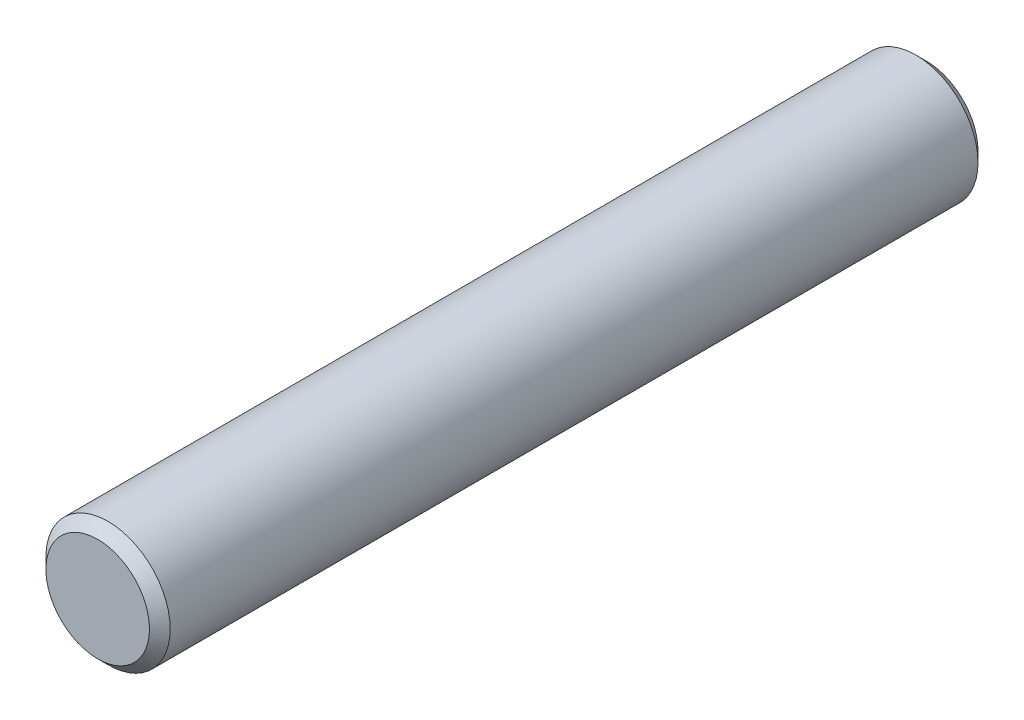
ISO-10303-21;
HEADER;
FILE_DESCRIPTION(('STEP AP214'),'2;1');
FILE_NAME('part.step','',(''),(''),'','','');
FILE_SCHEMA(('AUTOMOTIVE_DESIGN { 1 0 10303 214 1 1 1 1 }'));
ENDSEC;
DATA;
#1=APPLICATION_CONTEXT('core data for automotive mechanical design processes');
#2=APPLICATION_PROTOCOL_DEFINITION('international standard','automotive_design',2000,#1);
#3=PRODUCT_CONTEXT('',#1,'mechanical');
#4=PRODUCT('Part','Part','',(#3));
#5=PRODUCT_RELATED_PRODUCT_CATEGORY('part','',(#4));
#6=PRODUCT_DEFINITION_FORMATION('','',#4);
#7=PRODUCT_DEFINITION_CONTEXT('part definition',#1,'design');
#8=PRODUCT_DEFINITION('design','',#6,#7);
#9=PRODUCT_DEFINITION_SHAPE('','',#8);
#10=(LENGTH_UNIT() NAMED_UNIT(*) SI_UNIT(.MILLI.,.METRE.));
#11=(NAMED_UNIT(*) PLANE_ANGLE_UNIT() SI_UNIT($,.RADIAN.));
#12=(NAMED_UNIT(*) SI_UNIT($,.STERADIAN.) SOLID_ANGLE_UNIT());
#13=UNCERTAINTY_MEASURE_WITH_UNIT(LENGTH_MEASURE(1.E-05),#10,'distance_accuracy_value','');
#14=(GEOMETRIC_REPRESENTATION_CONTEXT(3) GLOBAL_UNCERTAINTY_ASSIGNED_CONTEXT((#13)) GLOBAL_UNIT_ASSIGNED_CONTEXT((#10,
#11,#12)) REPRESENTATION_CONTEXT('',''));
#15=CARTESIAN_POINT('',(0.,0.,0.));
#16=DIRECTION('',(0.,0.,1.));
#17=DIRECTION('',(1.,0.,0.));
#18=AXIS2_PLACEMENT_3D('',#15,#16,#17);
#19=CARTESIAN_POINT('',(0.,0.,10.));
#20=DIRECTION('',(0.,0.,-1.));
#21=DIRECTION('',(-1.,0.,0.));
#22=AXIS2_PLACEMENT_3D('',#19,#20,#21);
#23=CYLINDRICAL_SURFACE('',#22,1.5);
#24=CARTESIAN_POINT('',(0.,0.,-9.75));
#25=DIRECTION('',(0.,0.,1.));
#26=DIRECTION('',(1.,0.,0.));
#27=AXIS2_PLACEMENT_3D('',#24,#25,#26);
#28=CIRCLE('',#27,1.5);
#29=CARTESIAN_POINT('',(1.5,0.,-9.75));
#30=VERTEX_POINT('',#29);
#31=EDGE_CURVE('E59',#30,#30,#28,.T.);
#32=ORIENTED_EDGE('',*,*,#31,.T.);
#33=EDGE_LOOP('',(#32));
#34=FACE_BOUND('',#33,.T.);
#35=CARTESIAN_POINT('',(0.,0.,9.74999999999999));
#36=DIRECTION('',(0.,0.,1.));
#37=DIRECTION('',(1.,0.,0.));
#38=AXIS2_PLACEMENT_3D('',#35,#36,#37);
#39=CIRCLE('',#38,1.5);
#40=CARTESIAN_POINT('',(1.5,0.,9.74999999999999));
#41=VERTEX_POINT('',#40);
#42=EDGE_CURVE('E64',#41,#41,#39,.F.);
#43=ORIENTED_EDGE('',*,*,#42,.T.);
#44=EDGE_LOOP('',(#43));
#45=FACE_BOUND('',#44,.T.);
#46=ADVANCED_FACE('F45',(#34,#45),#23,.T.);
#47=CARTESIAN_POINT('',(0.,0.,10.));
#48=DIRECTION('',(0.,0.,1.));
#49=DIRECTION('',(1.,0.,0.));
#50=AXIS2_PLACEMENT_3D('',#47,#48,#49);
#51=PLANE('',#50);
#52=CARTESIAN_POINT('',(0.,0.,10.));
#53=DIRECTION('',(0.,0.,1.));
#54=DIRECTION('',(1.,0.,0.));
#55=AXIS2_PLACEMENT_3D('',#52,#53,#54);
#56=CIRCLE('',#55,1.25);
#57=CARTESIAN_POINT('',(1.25,0.,10.));
#58=VERTEX_POINT('',#57);
#59=EDGE_CURVE('E10',#58,#58,#56,.T.);
#60=ORIENTED_EDGE('',*,*,#59,.T.);
#61=EDGE_LOOP('',(#60));
#62=FACE_BOUND('',#61,.T.);
#63=ADVANCED_FACE('F81',(#62),#51,.T.);
#64=CARTESIAN_POINT('',(0.,0.,-10.));
#65=DIRECTION('',(0.,0.,1.));
#66=DIRECTION('',(1.,0.,0.));
#67=AXIS2_PLACEMENT_3D('',#64,#65,#66);
#68=PLANE('',#67);
#69=CARTESIAN_POINT('',(0.,0.,-10.));
#70=DIRECTION('',(0.,0.,1.));
#71=DIRECTION('',(1.,0.,0.));
#72=AXIS2_PLACEMENT_3D('',#69,#70,#71);
#73=CIRCLE('',#72,1.25);
#74=CARTESIAN_POINT('',(1.25,0.,-10.));
#75=VERTEX_POINT('',#74);
#76=EDGE_CURVE('E54',#75,#75,#73,.F.);
#77=ORIENTED_EDGE('',*,*,#76,.T.);
#78=EDGE_LOOP('',(#77));
#79=FACE_BOUND('',#78,.T.);
#80=ADVANCED_FACE('F78',(#79),#68,.F.);
#81=CARTESIAN_POINT('',(0.,0.,-9.75));
#82=DIRECTION('',(0.,0.,1.));
#83=DIRECTION('',(1.,0.,0.));
#84=AXIS2_PLACEMENT_3D('',#81,#82,#83);
#85=CONICAL_SURFACE('',#84,1.5,0.785398163397448);
#86=ORIENTED_EDGE('',*,*,#76,.F.);
#87=EDGE_LOOP('',(#86));
#88=FACE_BOUND('',#87,.T.);
#89=ORIENTED_EDGE('',*,*,#31,.F.);
#90=EDGE_LOOP('',(#89));
#91=FACE_BOUND('',#90,.T.);
#92=ADVANCED_FACE('F74',(#88,#91),#85,.T.);
#93=CARTESIAN_POINT('',(0.,0.,10.));
#94=DIRECTION('',(0.,0.,-1.));
#95=DIRECTION('',(-1.,0.,0.));
#96=AXIS2_PLACEMENT_3D('',#93,#94,#95);
#97=CONICAL_SURFACE('',#96,1.25,0.785398163397445);
#98=ORIENTED_EDGE('',*,*,#42,.F.);
#99=EDGE_LOOP('',(#98));
#100=FACE_BOUND('',#99,.T.);
#101=ORIENTED_EDGE('',*,*,#59,.F.);
#102=EDGE_LOOP('',(#101));
#103=FACE_BOUND('',#102,.T.);
#104=ADVANCED_FACE('F48',(#100,#103),#97,.T.);
#105=CLOSED_SHELL('',(#46,#63,#80,#92,#104));
#106=MANIFOLD_SOLID_BREP('B2',#105);
#107=ADVANCED_BREP_SHAPE_REPRESENTATION('',(#18,#106),#14);
#108=SHAPE_DEFINITION_REPRESENTATION(#9,#107);
ENDSEC;
END-ISO-10303-21;
